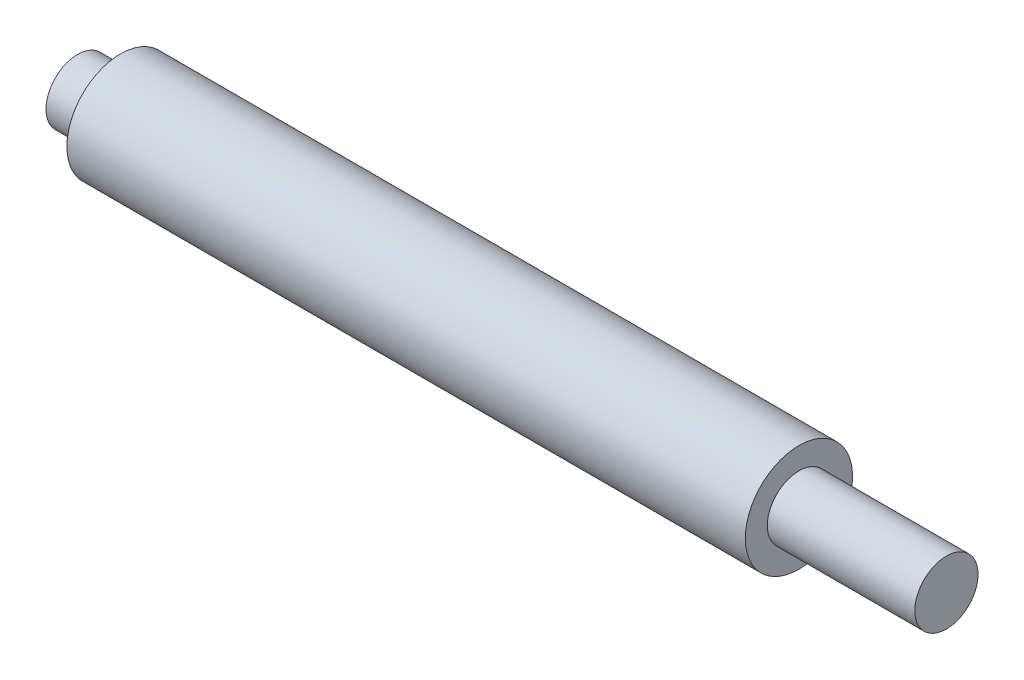
ISO-10303-21;
HEADER;
FILE_DESCRIPTION(('STEP AP214'),'2;1');
FILE_NAME('part.step','',(''),(''),'','','');
FILE_SCHEMA(('AUTOMOTIVE_DESIGN { 1 0 10303 214 1 1 1 1 }'));
ENDSEC;
DATA;
#1=APPLICATION_CONTEXT('core data for automotive mechanical design processes');
#2=APPLICATION_PROTOCOL_DEFINITION('international standard','automotive_design',2000,#1);
#3=PRODUCT_CONTEXT('',#1,'mechanical');
#4=PRODUCT('Part','Part','',(#3));
#5=PRODUCT_RELATED_PRODUCT_CATEGORY('part','',(#4));
#6=PRODUCT_DEFINITION_FORMATION('','',#4);
#7=PRODUCT_DEFINITION_CONTEXT('part definition',#1,'design');
#8=PRODUCT_DEFINITION('design','',#6,#7);
#9=PRODUCT_DEFINITION_SHAPE('','',#8);
#10=(LENGTH_UNIT() NAMED_UNIT(*) SI_UNIT(.MILLI.,.METRE.));
#11=(NAMED_UNIT(*) PLANE_ANGLE_UNIT() SI_UNIT($,.RADIAN.));
#12=(NAMED_UNIT(*) SI_UNIT($,.STERADIAN.) SOLID_ANGLE_UNIT());
#13=UNCERTAINTY_MEASURE_WITH_UNIT(LENGTH_MEASURE(1.E-05),#10,'distance_accuracy_value','');
#14=(GEOMETRIC_REPRESENTATION_CONTEXT(3) GLOBAL_UNCERTAINTY_ASSIGNED_CONTEXT((#13)) GLOBAL_UNIT_ASSIGNED_CONTEXT((#10,
#11,#12)) REPRESENTATION_CONTEXT('',''));
#15=CARTESIAN_POINT('',(0.,0.,0.));
#16=DIRECTION('',(0.,0.,1.));
#17=DIRECTION('',(1.,0.,0.));
#18=AXIS2_PLACEMENT_3D('',#15,#16,#17);
#19=CARTESIAN_POINT('',(0.,2.95,0.));
#20=DIRECTION('',(1.,0.,0.));
#21=DIRECTION('',(0.,0.,-1.));
#22=AXIS2_PLACEMENT_3D('',#19,#20,#21);
#23=PLANE('',#22);
#24=CARTESIAN_POINT('',(0.,0.,0.));
#25=DIRECTION('',(-1.,0.,0.));
#26=DIRECTION('',(0.,0.,1.));
#27=AXIS2_PLACEMENT_3D('',#24,#25,#26);
#28=CIRCLE('',#27,2.95);
#29=CARTESIAN_POINT('',(0.,0.,2.95));
#30=VERTEX_POINT('',#29);
#31=EDGE_CURVE('E55',#30,#30,#28,.T.);
#32=ORIENTED_EDGE('',*,*,#31,.T.);
#33=EDGE_LOOP('',(#32));
#34=FACE_BOUND('',#33,.T.);
#35=ADVANCED_FACE('F33',(#34),#23,.F.);
#36=CARTESIAN_POINT('',(81.,0.,0.));
#37=DIRECTION('',(-1.,0.,0.));
#38=DIRECTION('',(0.,0.,1.));
#39=AXIS2_PLACEMENT_3D('',#36,#37,#38);
#40=PLANE('',#39);
#41=CARTESIAN_POINT('',(81.,0.,0.));
#42=DIRECTION('',(-1.,0.,0.));
#43=DIRECTION('',(0.,0.,1.));
#44=AXIS2_PLACEMENT_3D('',#41,#42,#43);
#45=CIRCLE('',#44,2.95000000000001);
#46=CARTESIAN_POINT('',(81.,0.,2.95000000000001));
#47=VERTEX_POINT('',#46);
#48=EDGE_CURVE('E10',#47,#47,#45,.T.);
#49=ORIENTED_EDGE('',*,*,#48,.F.);
#50=EDGE_LOOP('',(#49));
#51=FACE_BOUND('',#50,.T.);
#52=ADVANCED_FACE('F85',(#51),#40,.F.);
#53=CARTESIAN_POINT('',(0.,0.,0.));
#54=DIRECTION('',(-1.,0.,0.));
#55=DIRECTION('',(0.,0.,1.));
#56=AXIS2_PLACEMENT_3D('',#53,#54,#55);
#57=CYLINDRICAL_SURFACE('',#56,2.95000000000001);
#58=CARTESIAN_POINT('',(67.25,0.,0.));
#59=DIRECTION('',(-1.,0.,0.));
#60=DIRECTION('',(0.,0.,1.));
#61=AXIS2_PLACEMENT_3D('',#58,#59,#60);
#62=CIRCLE('',#61,2.95000000000001);
#63=CARTESIAN_POINT('',(67.25,0.,2.95000000000001));
#64=VERTEX_POINT('',#63);
#65=EDGE_CURVE('E39',#64,#64,#62,.T.);
#66=ORIENTED_EDGE('',*,*,#65,.F.);
#67=EDGE_LOOP('',(#66));
#68=FACE_BOUND('',#67,.T.);
#69=ORIENTED_EDGE('',*,*,#48,.T.);
#70=EDGE_LOOP('',(#69));
#71=FACE_BOUND('',#70,.T.);
#72=ADVANCED_FACE('F80',(#68,#71),#57,.T.);
#73=CARTESIAN_POINT('',(67.25,2.95000000000001,0.));
#74=DIRECTION('',(-1.,0.,0.));
#75=DIRECTION('',(0.,0.,1.));
#76=AXIS2_PLACEMENT_3D('',#73,#74,#75);
#77=PLANE('',#76);
#78=CARTESIAN_POINT('',(67.25,0.,0.));
#79=DIRECTION('',(-1.,0.,0.));
#80=DIRECTION('',(0.,0.,1.));
#81=AXIS2_PLACEMENT_3D('',#78,#79,#80);
#82=CIRCLE('',#81,5.);
#83=CARTESIAN_POINT('',(67.25,0.,5.));
#84=VERTEX_POINT('',#83);
#85=EDGE_CURVE('E43',#84,#84,#82,.T.);
#86=ORIENTED_EDGE('',*,*,#85,.F.);
#87=EDGE_LOOP('',(#86));
#88=FACE_BOUND('',#87,.T.);
#89=ORIENTED_EDGE('',*,*,#65,.T.);
#90=EDGE_LOOP('',(#89));
#91=FACE_BOUND('',#90,.T.);
#92=ADVANCED_FACE('F75',(#88,#91),#77,.F.);
#93=CARTESIAN_POINT('',(0.,0.,0.));
#94=DIRECTION('',(-1.,0.,0.));
#95=DIRECTION('',(0.,0.,1.));
#96=AXIS2_PLACEMENT_3D('',#93,#94,#95);
#97=CYLINDRICAL_SURFACE('',#96,5.);
#98=CARTESIAN_POINT('',(4.,0.,0.));
#99=DIRECTION('',(-1.,0.,0.));
#100=DIRECTION('',(0.,0.,1.));
#101=AXIS2_PLACEMENT_3D('',#98,#99,#100);
#102=CIRCLE('',#101,4.99999999999999);
#103=CARTESIAN_POINT('',(4.,0.,4.99999999999999));
#104=VERTEX_POINT('',#103);
#105=EDGE_CURVE('E47',#104,#104,#102,.T.);
#106=ORIENTED_EDGE('',*,*,#105,.F.);
#107=EDGE_LOOP('',(#106));
#108=FACE_BOUND('',#107,.T.);
#109=ORIENTED_EDGE('',*,*,#85,.T.);
#110=EDGE_LOOP('',(#109));
#111=FACE_BOUND('',#110,.T.);
#112=ADVANCED_FACE('F69',(#108,#111),#97,.T.);
#113=CARTESIAN_POINT('',(4.,4.99999999999999,0.));
#114=DIRECTION('',(1.,0.,0.));
#115=DIRECTION('',(0.,0.,-1.));
#116=AXIS2_PLACEMENT_3D('',#113,#114,#115);
#117=PLANE('',#116);
#118=CARTESIAN_POINT('',(4.,0.,0.));
#119=DIRECTION('',(-1.,0.,0.));
#120=DIRECTION('',(0.,0.,1.));
#121=AXIS2_PLACEMENT_3D('',#118,#119,#120);
#122=CIRCLE('',#121,2.95);
#123=CARTESIAN_POINT('',(4.,0.,2.95));
#124=VERTEX_POINT('',#123);
#125=EDGE_CURVE('E52',#124,#124,#122,.T.);
#126=ORIENTED_EDGE('',*,*,#125,.F.);
#127=EDGE_LOOP('',(#126));
#128=FACE_BOUND('',#127,.T.);
#129=ORIENTED_EDGE('',*,*,#105,.T.);
#130=EDGE_LOOP('',(#129));
#131=FACE_BOUND('',#130,.T.);
#132=ADVANCED_FACE('F63',(#128,#131),#117,.F.);
#133=CARTESIAN_POINT('',(0.,0.,0.));
#134=DIRECTION('',(-1.,0.,0.));
#135=DIRECTION('',(0.,0.,1.));
#136=AXIS2_PLACEMENT_3D('',#133,#134,#135);
#137=CYLINDRICAL_SURFACE('',#136,2.95);
#138=ORIENTED_EDGE('',*,*,#31,.F.);
#139=EDGE_LOOP('',(#138));
#140=FACE_BOUND('',#139,.T.);
#141=ORIENTED_EDGE('',*,*,#125,.T.);
#142=EDGE_LOOP('',(#141));
#143=FACE_BOUND('',#142,.T.);
#144=ADVANCED_FACE('F60',(#140,#143),#137,.T.);
#145=CLOSED_SHELL('',(#35,#52,#72,#92,#112,#132,#144));
#146=MANIFOLD_SOLID_BREP('B2',#145);
#147=ADVANCED_BREP_SHAPE_REPRESENTATION('',(#18,#146),#14);
#148=SHAPE_DEFINITION_REPRESENTATION(#9,#147);
ENDSEC;
END-ISO-10303-21;
